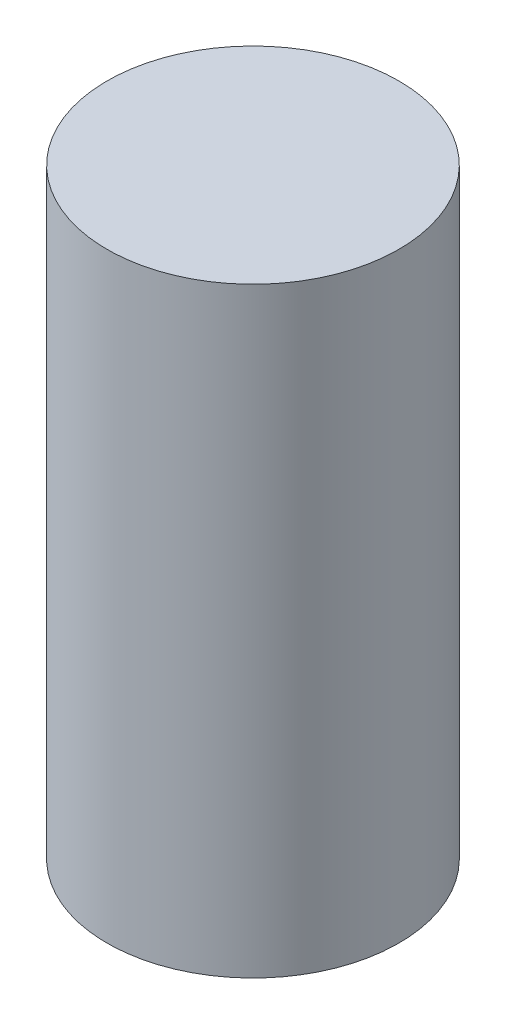
ISO-10303-21;
HEADER;
FILE_DESCRIPTION(('STEP AP214'),'2;1');
FILE_NAME('part.step','',(''),(''),'','','');
FILE_SCHEMA(('AUTOMOTIVE_DESIGN { 1 0 10303 214 1 1 1 1 }'));
ENDSEC;
DATA;
#1=APPLICATION_CONTEXT('core data for automotive mechanical design processes');
#2=APPLICATION_PROTOCOL_DEFINITION('international standard','automotive_design',2000,#1);
#3=PRODUCT_CONTEXT('',#1,'mechanical');
#4=PRODUCT('Part','Part','',(#3));
#5=PRODUCT_RELATED_PRODUCT_CATEGORY('part','',(#4));
#6=PRODUCT_DEFINITION_FORMATION('','',#4);
#7=PRODUCT_DEFINITION_CONTEXT('part definition',#1,'design');
#8=PRODUCT_DEFINITION('design','',#6,#7);
#9=PRODUCT_DEFINITION_SHAPE('','',#8);
#10=(LENGTH_UNIT() NAMED_UNIT(*) SI_UNIT(.MILLI.,.METRE.));
#11=(NAMED_UNIT(*) PLANE_ANGLE_UNIT() SI_UNIT($,.RADIAN.));
#12=(NAMED_UNIT(*) SI_UNIT($,.STERADIAN.) SOLID_ANGLE_UNIT());
#13=UNCERTAINTY_MEASURE_WITH_UNIT(LENGTH_MEASURE(1.E-05),#10,'distance_accuracy_value','');
#14=(GEOMETRIC_REPRESENTATION_CONTEXT(3) GLOBAL_UNCERTAINTY_ASSIGNED_CONTEXT((#13)) GLOBAL_UNIT_ASSIGNED_CONTEXT((#10,
#11,#12)) REPRESENTATION_CONTEXT('',''));
#15=CARTESIAN_POINT('',(0.,0.,0.));
#16=DIRECTION('',(0.,0.,1.));
#17=DIRECTION('',(1.,0.,0.));
#18=AXIS2_PLACEMENT_3D('',#15,#16,#17);
#19=CARTESIAN_POINT('',(-1.397,0.150539843938794,0.));
#20=DIRECTION('',(0.,-1.,0.));
#21=DIRECTION('',(0.,0.,-1.));
#22=AXIS2_PLACEMENT_3D('',#19,#20,#21);
#23=CYLINDRICAL_SURFACE('',#22,1.397);
#24=CARTESIAN_POINT('',(-1.397,0.,0.));
#25=DIRECTION('',(0.,-1.,0.));
#26=DIRECTION('',(0.,0.,-1.));
#27=AXIS2_PLACEMENT_3D('',#24,#25,#26);
#28=CIRCLE('',#27,1.397);
#29=CARTESIAN_POINT('',(-1.397,0.,-1.397));
#30=VERTEX_POINT('',#29);
#31=EDGE_CURVE('E10',#30,#30,#28,.T.);
#32=ORIENTED_EDGE('',*,*,#31,.T.);
#33=EDGE_LOOP('',(#32));
#34=FACE_BOUND('',#33,.T.);
#35=CARTESIAN_POINT('',(-1.397,5.08,0.));
#36=DIRECTION('',(0.,-1.,0.));
#37=DIRECTION('',(0.,0.,-1.));
#38=AXIS2_PLACEMENT_3D('',#35,#36,#37);
#39=CIRCLE('',#38,1.397);
#40=CARTESIAN_POINT('',(-1.397,5.08,-1.397));
#41=VERTEX_POINT('',#40);
#42=EDGE_CURVE('E45',#41,#41,#39,.T.);
#43=ORIENTED_EDGE('',*,*,#42,.F.);
#44=EDGE_LOOP('',(#43));
#45=FACE_BOUND('',#44,.T.);
#46=ADVANCED_FACE('F31',(#34,#45),#23,.F.);
#47=CARTESIAN_POINT('',(0.,0.,0.));
#48=DIRECTION('',(0.,-1.,0.));
#49=DIRECTION('',(0.,0.,-1.));
#50=AXIS2_PLACEMENT_3D('',#47,#48,#49);
#51=PLANE('',#50);
#52=CARTESIAN_POINT('',(-1.397,0.,0.));
#53=DIRECTION('',(0.,-1.,0.));
#54=DIRECTION('',(0.,0.,-1.));
#55=AXIS2_PLACEMENT_3D('',#52,#53,#54);
#56=CIRCLE('',#55,2.159);
#57=CARTESIAN_POINT('',(-1.397,0.,-2.159));
#58=VERTEX_POINT('',#57);
#59=EDGE_CURVE('E37',#58,#58,#56,.T.);
#60=ORIENTED_EDGE('',*,*,#59,.T.);
#61=EDGE_LOOP('',(#60));
#62=FACE_BOUND('',#61,.T.);
#63=ORIENTED_EDGE('',*,*,#31,.F.);
#64=EDGE_LOOP('',(#63));
#65=FACE_BOUND('',#64,.T.);
#66=ADVANCED_FACE('F54',(#62,#65),#51,.T.);
#67=CARTESIAN_POINT('',(-1.397,0.150539843938794,0.));
#68=DIRECTION('',(0.,-1.,0.));
#69=DIRECTION('',(0.,0.,-1.));
#70=AXIS2_PLACEMENT_3D('',#67,#68,#69);
#71=CYLINDRICAL_SURFACE('',#70,2.159);
#72=CARTESIAN_POINT('',(-1.397,8.89,0.));
#73=DIRECTION('',(0.,-1.,0.));
#74=DIRECTION('',(0.,0.,-1.));
#75=AXIS2_PLACEMENT_3D('',#72,#73,#74);
#76=CIRCLE('',#75,2.159);
#77=CARTESIAN_POINT('',(-1.397,8.89,-2.159));
#78=VERTEX_POINT('',#77);
#79=EDGE_CURVE('E41',#78,#78,#76,.T.);
#80=ORIENTED_EDGE('',*,*,#79,.T.);
#81=EDGE_LOOP('',(#80));
#82=FACE_BOUND('',#81,.T.);
#83=ORIENTED_EDGE('',*,*,#59,.F.);
#84=EDGE_LOOP('',(#83));
#85=FACE_BOUND('',#84,.T.);
#86=ADVANCED_FACE('F58',(#82,#85),#71,.T.);
#87=CARTESIAN_POINT('',(0.762000000000001,8.89,0.));
#88=DIRECTION('',(0.,1.,0.));
#89=DIRECTION('',(0.,0.,1.));
#90=AXIS2_PLACEMENT_3D('',#87,#88,#89);
#91=PLANE('',#90);
#92=ORIENTED_EDGE('',*,*,#79,.F.);
#93=EDGE_LOOP('',(#92));
#94=FACE_BOUND('',#93,.T.);
#95=ADVANCED_FACE('F62',(#94),#91,.T.);
#96=CARTESIAN_POINT('',(-1.397,5.08,0.));
#97=DIRECTION('',(0.,-1.,0.));
#98=DIRECTION('',(0.,0.,-1.));
#99=AXIS2_PLACEMENT_3D('',#96,#97,#98);
#100=PLANE('',#99);
#101=ORIENTED_EDGE('',*,*,#42,.T.);
#102=EDGE_LOOP('',(#101));
#103=FACE_BOUND('',#102,.T.);
#104=ADVANCED_FACE('F51',(#103),#100,.T.);
#105=CLOSED_SHELL('',(#46,#66,#86,#95,#104));
#106=MANIFOLD_SOLID_BREP('B2',#105);
#107=ADVANCED_BREP_SHAPE_REPRESENTATION('',(#18,#106),#14);
#108=SHAPE_DEFINITION_REPRESENTATION(#9,#107);
ENDSEC;
END-ISO-10303-21;
